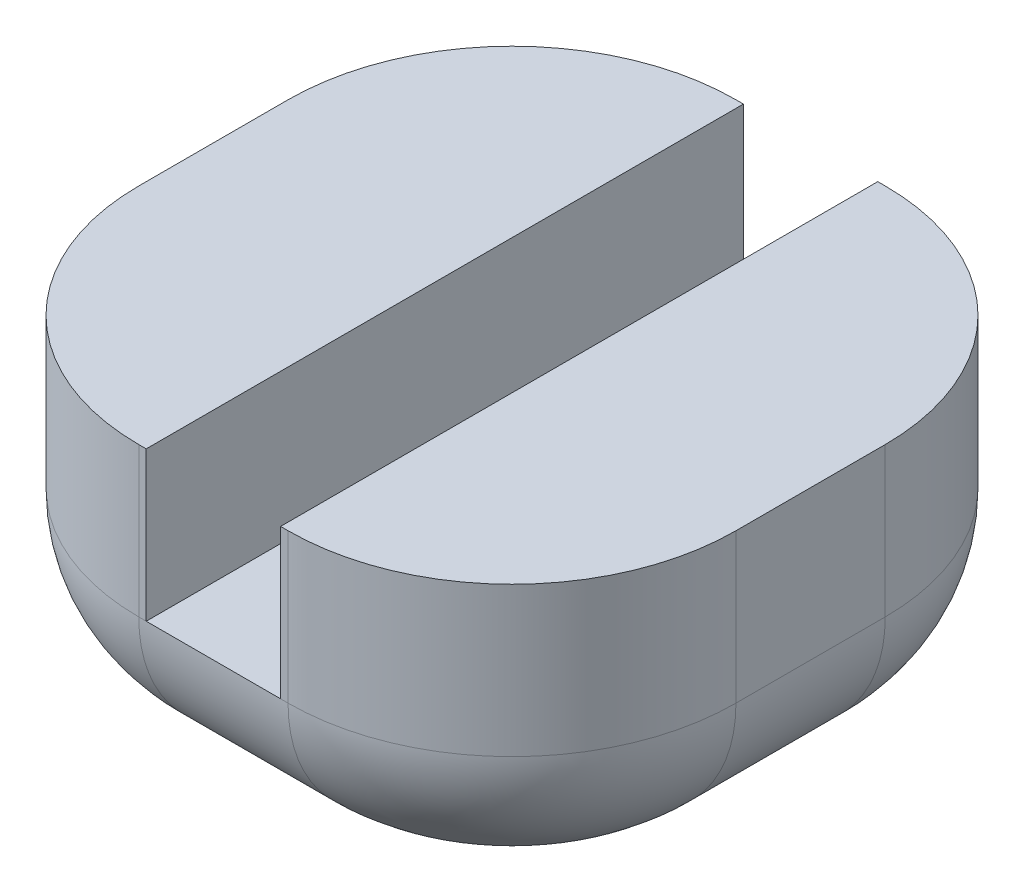
ISO-10303-21;
HEADER;
FILE_DESCRIPTION(('STEP AP214'),'2;1');
FILE_NAME('part.step','',(''),(''),'','','');
FILE_SCHEMA(('AUTOMOTIVE_DESIGN { 1 0 10303 214 1 1 1 1 }'));
ENDSEC;
DATA;
#1=APPLICATION_CONTEXT('core data for automotive mechanical design processes');
#2=APPLICATION_PROTOCOL_DEFINITION('international standard','automotive_design',2000,#1);
#3=PRODUCT_CONTEXT('',#1,'mechanical');
#4=PRODUCT('Part','Part','',(#3));
#5=PRODUCT_RELATED_PRODUCT_CATEGORY('part','',(#4));
#6=PRODUCT_DEFINITION_FORMATION('','',#4);
#7=PRODUCT_DEFINITION_CONTEXT('part definition',#1,'design');
#8=PRODUCT_DEFINITION('design','',#6,#7);
#9=PRODUCT_DEFINITION_SHAPE('','',#8);
#10=(LENGTH_UNIT() NAMED_UNIT(*) SI_UNIT(.MILLI.,.METRE.));
#11=(NAMED_UNIT(*) PLANE_ANGLE_UNIT() SI_UNIT($,.RADIAN.));
#12=(NAMED_UNIT(*) SI_UNIT($,.STERADIAN.) SOLID_ANGLE_UNIT());
#13=UNCERTAINTY_MEASURE_WITH_UNIT(LENGTH_MEASURE(1.E-05),#10,'distance_accuracy_value','');
#14=(GEOMETRIC_REPRESENTATION_CONTEXT(3) GLOBAL_UNCERTAINTY_ASSIGNED_CONTEXT((#13)) GLOBAL_UNIT_ASSIGNED_CONTEXT((#10,
#11,#12)) REPRESENTATION_CONTEXT('',''));
#15=CARTESIAN_POINT('',(0.,0.,0.));
#16=DIRECTION('',(0.,0.,1.));
#17=DIRECTION('',(1.,0.,0.));
#18=AXIS2_PLACEMENT_3D('',#15,#16,#17);
#19=CARTESIAN_POINT('',(2.,2.,-2.));
#20=DIRECTION('',(0.,0.,1.));
#21=DIRECTION('',(1.,0.,0.));
#22=AXIS2_PLACEMENT_3D('',#19,#20,#21);
#23=PLANE('',#22);
#24=DIRECTION('',(0.,-1.,0.));
#25=VECTOR('',#24,1.);
#26=CARTESIAN_POINT('',(0.5,2.,-2.));
#27=LINE('',#26,#25);
#28=CARTESIAN_POINT('',(0.5,2.,-2.));
#29=VERTEX_POINT('',#28);
#30=CARTESIAN_POINT('',(0.5,1.,-2.));
#31=VERTEX_POINT('',#30);
#32=EDGE_CURVE('E236',#29,#31,#27,.T.);
#33=ORIENTED_EDGE('',*,*,#32,.T.);
#34=DIRECTION('',(-1.,0.,0.));
#35=VECTOR('',#34,1.);
#36=CARTESIAN_POINT('',(2.,1.,-2.));
#37=LINE('',#36,#35);
#38=CARTESIAN_POINT('',(0.45,1.,-2.));
#39=VERTEX_POINT('',#38);
#40=EDGE_CURVE('E11',#31,#39,#37,.T.);
#41=ORIENTED_EDGE('',*,*,#40,.T.);
#42=DIRECTION('',(0.,1.,0.));
#43=VECTOR('',#42,1.);
#44=CARTESIAN_POINT('',(0.45,1.,-2.));
#45=LINE('',#44,#43);
#46=CARTESIAN_POINT('',(0.45,2.,-2.));
#47=VERTEX_POINT('',#46);
#48=EDGE_CURVE('E212',#39,#47,#45,.T.);
#49=ORIENTED_EDGE('',*,*,#48,.T.);
#50=DIRECTION('',(-1.,0.,0.));
#51=VECTOR('',#50,1.);
#52=CARTESIAN_POINT('',(2.,2.,-2.));
#53=LINE('',#52,#51);
#54=EDGE_CURVE('E229',#29,#47,#53,.T.);
#55=ORIENTED_EDGE('',*,*,#54,.F.);
#56=EDGE_LOOP('',(#33,#41,#49,#55));
#57=FACE_BOUND('',#56,.T.);
#58=ADVANCED_FACE('F38',(#57),#23,.F.);
#59=CARTESIAN_POINT('',(2.,2.,2.));
#60=DIRECTION('',(0.,0.,-1.));
#61=DIRECTION('',(-1.,0.,0.));
#62=AXIS2_PLACEMENT_3D('',#59,#60,#61);
#63=PLANE('',#62);
#64=DIRECTION('',(0.,-1.,0.));
#65=VECTOR('',#64,1.);
#66=CARTESIAN_POINT('',(-0.5,2.,2.));
#67=LINE('',#66,#65);
#68=CARTESIAN_POINT('',(-0.5,2.,2.));
#69=VERTEX_POINT('',#68);
#70=CARTESIAN_POINT('',(-0.5,1.,2.));
#71=VERTEX_POINT('',#70);
#72=EDGE_CURVE('E168',#69,#71,#67,.T.);
#73=ORIENTED_EDGE('',*,*,#72,.T.);
#74=DIRECTION('',(1.,0.,0.));
#75=VECTOR('',#74,1.);
#76=CARTESIAN_POINT('',(2.,1.,2.));
#77=LINE('',#76,#75);
#78=CARTESIAN_POINT('',(-0.45,1.,2.));
#79=VERTEX_POINT('',#78);
#80=EDGE_CURVE('E160',#71,#79,#77,.T.);
#81=ORIENTED_EDGE('',*,*,#80,.T.);
#82=DIRECTION('',(0.,1.,0.));
#83=VECTOR('',#82,1.);
#84=CARTESIAN_POINT('',(-0.45,1.,2.));
#85=LINE('',#84,#83);
#86=CARTESIAN_POINT('',(-0.45,2.,2.));
#87=VERTEX_POINT('',#86);
#88=EDGE_CURVE('E165',#79,#87,#85,.T.);
#89=ORIENTED_EDGE('',*,*,#88,.T.);
#90=DIRECTION('',(1.,0.,0.));
#91=VECTOR('',#90,1.);
#92=CARTESIAN_POINT('',(2.,2.,2.));
#93=LINE('',#92,#91);
#94=EDGE_CURVE('E223',#69,#87,#93,.T.);
#95=ORIENTED_EDGE('',*,*,#94,.F.);
#96=EDGE_LOOP('',(#73,#81,#89,#95));
#97=FACE_BOUND('',#96,.T.);
#98=ADVANCED_FACE('F162',(#97),#63,.F.);
#99=CARTESIAN_POINT('',(0.,2.,0.));
#100=DIRECTION('',(0.,1.,0.));
#101=DIRECTION('',(0.,0.,1.));
#102=AXIS2_PLACEMENT_3D('',#99,#100,#101);
#103=PLANE('',#102);
#104=DIRECTION('',(0.,0.,1.));
#105=VECTOR('',#104,1.);
#106=CARTESIAN_POINT('',(-0.45,2.,2.));
#107=LINE('',#106,#105);
#108=CARTESIAN_POINT('',(-0.45,2.,-2.));
#109=VERTEX_POINT('',#108);
#110=EDGE_CURVE('E192',#109,#87,#107,.T.);
#111=ORIENTED_EDGE('',*,*,#110,.F.);
#112=CARTESIAN_POINT('',(-0.5,2.,-2.));
#113=VERTEX_POINT('',#112);
#114=EDGE_CURVE('E228',#109,#113,#53,.T.);
#115=ORIENTED_EDGE('',*,*,#114,.T.);
#116=CARTESIAN_POINT('',(-0.5,2.,-0.499999999999999));
#117=DIRECTION('',(0.,1.,0.));
#118=DIRECTION('',(0.,0.,1.));
#119=AXIS2_PLACEMENT_3D('',#116,#117,#118);
#120=CIRCLE('',#119,1.5);
#121=CARTESIAN_POINT('',(-2.,2.,-0.499999999999999));
#122=VERTEX_POINT('',#121);
#123=EDGE_CURVE('E247',#113,#122,#120,.T.);
#124=ORIENTED_EDGE('',*,*,#123,.T.);
#125=DIRECTION('',(0.,0.,1.));
#126=VECTOR('',#125,1.);
#127=CARTESIAN_POINT('',(-2.,2.,2.));
#128=LINE('',#127,#126);
#129=CARTESIAN_POINT('',(-2.,2.,0.500000000000001));
#130=VERTEX_POINT('',#129);
#131=EDGE_CURVE('E219',#122,#130,#128,.T.);
#132=ORIENTED_EDGE('',*,*,#131,.T.);
#133=CARTESIAN_POINT('',(-0.5,2.,0.500000000000001));
#134=DIRECTION('',(0.,1.,0.));
#135=DIRECTION('',(0.,0.,1.));
#136=AXIS2_PLACEMENT_3D('',#133,#134,#135);
#137=CIRCLE('',#136,1.5);
#138=EDGE_CURVE('E241',#130,#69,#137,.T.);
#139=ORIENTED_EDGE('',*,*,#138,.T.);
#140=ORIENTED_EDGE('',*,*,#94,.T.);
#141=EDGE_LOOP('',(#111,#115,#124,#132,#139,#140));
#142=FACE_BOUND('',#141,.T.);
#143=ADVANCED_FACE('F324',(#142),#103,.T.);
#144=CARTESIAN_POINT('',(0.,0.,0.));
#145=DIRECTION('',(0.,1.,0.));
#146=DIRECTION('',(0.,0.,1.));
#147=AXIS2_PLACEMENT_3D('',#144,#145,#146);
#148=CYLINDRICAL_SURFACE('',#147,0.45);
#149=CARTESIAN_POINT('',(0.,0.,0.));
#150=DIRECTION('',(0.,1.,0.));
#151=DIRECTION('',(0.,0.,1.));
#152=AXIS2_PLACEMENT_3D('',#149,#150,#151);
#153=CIRCLE('',#152,0.45);
#154=CARTESIAN_POINT('',(0.,0.,0.45));
#155=VERTEX_POINT('',#154);
#156=EDGE_CURVE('E211',#155,#155,#153,.T.);
#157=ORIENTED_EDGE('',*,*,#156,.F.);
#158=EDGE_LOOP('',(#157));
#159=FACE_BOUND('',#158,.T.);
#160=CARTESIAN_POINT('',(0.,1.,0.));
#161=DIRECTION('',(0.,1.,0.));
#162=DIRECTION('',(0.,0.,1.));
#163=AXIS2_PLACEMENT_3D('',#160,#161,#162);
#164=CIRCLE('',#163,0.45);
#165=CARTESIAN_POINT('',(-0.45,1.,0.));
#166=VERTEX_POINT('',#165);
#167=CARTESIAN_POINT('',(0.45,1.,0.));
#168=VERTEX_POINT('',#167);
#169=EDGE_CURVE('E258',#166,#168,#164,.F.);
#170=ORIENTED_EDGE('',*,*,#169,.F.);
#171=EDGE_CURVE('E184',#168,#166,#164,.F.);
#172=ORIENTED_EDGE('',*,*,#171,.F.);
#173=EDGE_LOOP('',(#170,#172));
#174=FACE_BOUND('',#173,.T.);
#175=ADVANCED_FACE('F383',(#159,#174),#148,.F.);
#176=CARTESIAN_POINT('',(-2.,2.,2.));
#177=DIRECTION('',(1.,0.,0.));
#178=DIRECTION('',(0.,0.,-1.));
#179=AXIS2_PLACEMENT_3D('',#176,#177,#178);
#180=PLANE('',#179);
#181=DIRECTION('',(0.,-1.,0.));
#182=VECTOR('',#181,1.);
#183=CARTESIAN_POINT('',(-2.,2.,-0.499999999999999));
#184=LINE('',#183,#182);
#185=CARTESIAN_POINT('',(-2.,1.,-0.499999999999999));
#186=VERTEX_POINT('',#185);
#187=EDGE_CURVE('E234',#122,#186,#184,.T.);
#188=ORIENTED_EDGE('',*,*,#187,.T.);
#189=DIRECTION('',(0.,0.,1.));
#190=VECTOR('',#189,1.);
#191=CARTESIAN_POINT('',(-2.,1.,2.));
#192=LINE('',#191,#190);
#193=CARTESIAN_POINT('',(-2.,1.,0.500000000000001));
#194=VERTEX_POINT('',#193);
#195=EDGE_CURVE('E285',#186,#194,#192,.T.);
#196=ORIENTED_EDGE('',*,*,#195,.T.);
#197=DIRECTION('',(0.,-1.,0.));
#198=VECTOR('',#197,1.);
#199=CARTESIAN_POINT('',(-2.,2.,0.500000000000001));
#200=LINE('',#199,#198);
#201=EDGE_CURVE('E232',#194,#130,#200,.F.);
#202=ORIENTED_EDGE('',*,*,#201,.T.);
#203=ORIENTED_EDGE('',*,*,#131,.F.);
#204=EDGE_LOOP('',(#188,#196,#202,#203));
#205=FACE_BOUND('',#204,.T.);
#206=ADVANCED_FACE('F322',(#205),#180,.F.);
#207=DIRECTION('',(0.,1.,0.));
#208=VECTOR('',#207,1.);
#209=CARTESIAN_POINT('',(0.45,1.,2.));
#210=LINE('',#209,#208);
#211=CARTESIAN_POINT('',(0.45,1.,2.));
#212=VERTEX_POINT('',#211);
#213=CARTESIAN_POINT('',(0.45,2.,2.));
#214=VERTEX_POINT('',#213);
#215=EDGE_CURVE('E193',#212,#214,#210,.T.);
#216=ORIENTED_EDGE('',*,*,#215,.F.);
#217=DIRECTION('',(1.,0.,0.));
#218=VECTOR('',#217,1.);
#219=CARTESIAN_POINT('',(2.,1.,2.));
#220=LINE('',#219,#218);
#221=CARTESIAN_POINT('',(0.5,1.,2.));
#222=VERTEX_POINT('',#221);
#223=EDGE_CURVE('E174',#212,#222,#220,.T.);
#224=ORIENTED_EDGE('',*,*,#223,.T.);
#225=DIRECTION('',(0.,-1.,0.));
#226=VECTOR('',#225,1.);
#227=CARTESIAN_POINT('',(0.5,2.,2.));
#228=LINE('',#227,#226);
#229=CARTESIAN_POINT('',(0.5,2.,2.));
#230=VERTEX_POINT('',#229);
#231=EDGE_CURVE('E255',#222,#230,#228,.F.);
#232=ORIENTED_EDGE('',*,*,#231,.T.);
#233=EDGE_CURVE('E222',#214,#230,#93,.T.);
#234=ORIENTED_EDGE('',*,*,#233,.F.);
#235=EDGE_LOOP('',(#216,#224,#232,#234));
#236=FACE_BOUND('',#235,.T.);
#237=ADVANCED_FACE('F374',(#236),#63,.F.);
#238=CARTESIAN_POINT('',(2.,2.,2.));
#239=DIRECTION('',(-1.,0.,0.));
#240=DIRECTION('',(0.,0.,1.));
#241=AXIS2_PLACEMENT_3D('',#238,#239,#240);
#242=PLANE('',#241);
#243=DIRECTION('',(0.,-1.,0.));
#244=VECTOR('',#243,1.);
#245=CARTESIAN_POINT('',(2.,2.,0.500000000000001));
#246=LINE('',#245,#244);
#247=CARTESIAN_POINT('',(2.,2.,0.500000000000001));
#248=VERTEX_POINT('',#247);
#249=CARTESIAN_POINT('',(2.,1.,0.500000000000001));
#250=VERTEX_POINT('',#249);
#251=EDGE_CURVE('E249',#248,#250,#246,.T.);
#252=ORIENTED_EDGE('',*,*,#251,.T.);
#253=DIRECTION('',(0.,0.,-1.));
#254=VECTOR('',#253,1.);
#255=CARTESIAN_POINT('',(2.,1.,2.));
#256=LINE('',#255,#254);
#257=CARTESIAN_POINT('',(2.,1.,-0.499999999999999));
#258=VERTEX_POINT('',#257);
#259=EDGE_CURVE('E279',#250,#258,#256,.T.);
#260=ORIENTED_EDGE('',*,*,#259,.T.);
#261=DIRECTION('',(0.,-1.,0.));
#262=VECTOR('',#261,1.);
#263=CARTESIAN_POINT('',(2.,2.,-0.499999999999999));
#264=LINE('',#263,#262);
#265=CARTESIAN_POINT('',(2.,2.,-0.499999999999999));
#266=VERTEX_POINT('',#265);
#267=EDGE_CURVE('E252',#258,#266,#264,.F.);
#268=ORIENTED_EDGE('',*,*,#267,.T.);
#269=DIRECTION('',(0.,0.,-1.));
#270=VECTOR('',#269,1.);
#271=CARTESIAN_POINT('',(2.,2.,2.));
#272=LINE('',#271,#270);
#273=EDGE_CURVE('E225',#248,#266,#272,.T.);
#274=ORIENTED_EDGE('',*,*,#273,.F.);
#275=EDGE_LOOP('',(#252,#260,#268,#274));
#276=FACE_BOUND('',#275,.T.);
#277=ADVANCED_FACE('F356',(#276),#242,.F.);
#278=DIRECTION('',(0.,1.,0.));
#279=VECTOR('',#278,1.);
#280=CARTESIAN_POINT('',(-0.45,1.,-2.));
#281=LINE('',#280,#279);
#282=CARTESIAN_POINT('',(-0.45,1.,-2.));
#283=VERTEX_POINT('',#282);
#284=EDGE_CURVE('E209',#283,#109,#281,.T.);
#285=ORIENTED_EDGE('',*,*,#284,.F.);
#286=DIRECTION('',(-1.,0.,0.));
#287=VECTOR('',#286,1.);
#288=CARTESIAN_POINT('',(2.,1.,-2.));
#289=LINE('',#288,#287);
#290=CARTESIAN_POINT('',(-0.5,1.,-2.));
#291=VERTEX_POINT('',#290);
#292=EDGE_CURVE('E47',#283,#291,#289,.T.);
#293=ORIENTED_EDGE('',*,*,#292,.T.);
#294=DIRECTION('',(0.,-1.,0.));
#295=VECTOR('',#294,1.);
#296=CARTESIAN_POINT('',(-0.5,2.,-2.));
#297=LINE('',#296,#295);
#298=EDGE_CURVE('E239',#291,#113,#297,.F.);
#299=ORIENTED_EDGE('',*,*,#298,.T.);
#300=ORIENTED_EDGE('',*,*,#114,.F.);
#301=EDGE_LOOP('',(#285,#293,#299,#300));
#302=FACE_BOUND('',#301,.T.);
#303=ADVANCED_FACE('F381',(#302),#23,.F.);
#304=DIRECTION('',(0.,0.,-1.));
#305=VECTOR('',#304,1.);
#306=CARTESIAN_POINT('',(0.45,2.,2.));
#307=LINE('',#306,#305);
#308=EDGE_CURVE('E188',#214,#47,#307,.T.);
#309=ORIENTED_EDGE('',*,*,#308,.F.);
#310=ORIENTED_EDGE('',*,*,#233,.T.);
#311=CARTESIAN_POINT('',(0.5,2.,0.500000000000001));
#312=DIRECTION('',(0.,1.,0.));
#313=DIRECTION('',(0.,0.,1.));
#314=AXIS2_PLACEMENT_3D('',#311,#312,#313);
#315=CIRCLE('',#314,1.5);
#316=EDGE_CURVE('E243',#230,#248,#315,.T.);
#317=ORIENTED_EDGE('',*,*,#316,.T.);
#318=ORIENTED_EDGE('',*,*,#273,.T.);
#319=CARTESIAN_POINT('',(0.5,2.,-0.499999999999999));
#320=DIRECTION('',(0.,1.,0.));
#321=DIRECTION('',(0.,0.,1.));
#322=AXIS2_PLACEMENT_3D('',#319,#320,#321);
#323=CIRCLE('',#322,1.5);
#324=EDGE_CURVE('E245',#266,#29,#323,.T.);
#325=ORIENTED_EDGE('',*,*,#324,.T.);
#326=ORIENTED_EDGE('',*,*,#54,.T.);
#327=EDGE_LOOP('',(#309,#310,#317,#318,#325,#326));
#328=FACE_BOUND('',#327,.T.);
#329=ADVANCED_FACE('F360',(#328),#103,.T.);
#330=CARTESIAN_POINT('',(0.,0.,0.));
#331=DIRECTION('',(0.,1.,0.));
#332=DIRECTION('',(0.,0.,1.));
#333=AXIS2_PLACEMENT_3D('',#330,#331,#332);
#334=PLANE('',#333);
#335=DIRECTION('',(-1.,0.,0.));
#336=VECTOR('',#335,1.);
#337=CARTESIAN_POINT('',(0.,0.,-0.999999999999999));
#338=LINE('',#337,#336);
#339=CARTESIAN_POINT('',(-0.5,0.,-0.999999999999999));
#340=VERTEX_POINT('',#339);
#341=CARTESIAN_POINT('',(0.5,0.,-0.999999999999999));
#342=VERTEX_POINT('',#341);
#343=EDGE_CURVE('E259',#340,#342,#338,.F.);
#344=ORIENTED_EDGE('',*,*,#343,.T.);
#345=CARTESIAN_POINT('',(0.5,0.,-0.499999999999999));
#346=DIRECTION('',(0.,1.,0.));
#347=DIRECTION('',(0.,0.,1.));
#348=AXIS2_PLACEMENT_3D('',#345,#346,#347);
#349=CIRCLE('',#348,0.5);
#350=CARTESIAN_POINT('',(1.,0.,-0.499999999999999));
#351=VERTEX_POINT('',#350);
#352=EDGE_CURVE('E273',#342,#351,#349,.F.);
#353=ORIENTED_EDGE('',*,*,#352,.T.);
#354=DIRECTION('',(0.,0.,-1.));
#355=VECTOR('',#354,1.);
#356=CARTESIAN_POINT('',(1.,0.,0.));
#357=LINE('',#356,#355);
#358=CARTESIAN_POINT('',(1.,0.,0.500000000000001));
#359=VERTEX_POINT('',#358);
#360=EDGE_CURVE('E271',#351,#359,#357,.F.);
#361=ORIENTED_EDGE('',*,*,#360,.T.);
#362=CARTESIAN_POINT('',(0.5,0.,0.500000000000001));
#363=DIRECTION('',(0.,1.,0.));
#364=DIRECTION('',(0.,0.,1.));
#365=AXIS2_PLACEMENT_3D('',#362,#363,#364);
#366=CIRCLE('',#365,0.5);
#367=CARTESIAN_POINT('',(0.5,0.,1.));
#368=VERTEX_POINT('',#367);
#369=EDGE_CURVE('E269',#359,#368,#366,.F.);
#370=ORIENTED_EDGE('',*,*,#369,.T.);
#371=DIRECTION('',(1.,0.,0.));
#372=VECTOR('',#371,1.);
#373=CARTESIAN_POINT('',(0.,0.,1.));
#374=LINE('',#373,#372);
#375=CARTESIAN_POINT('',(-0.5,0.,1.));
#376=VERTEX_POINT('',#375);
#377=EDGE_CURVE('E267',#368,#376,#374,.F.);
#378=ORIENTED_EDGE('',*,*,#377,.T.);
#379=CARTESIAN_POINT('',(-0.5,0.,0.500000000000001));
#380=DIRECTION('',(0.,1.,0.));
#381=DIRECTION('',(0.,0.,1.));
#382=AXIS2_PLACEMENT_3D('',#379,#380,#381);
#383=CIRCLE('',#382,0.5);
#384=CARTESIAN_POINT('',(-1.,0.,0.500000000000001));
#385=VERTEX_POINT('',#384);
#386=EDGE_CURVE('E265',#376,#385,#383,.F.);
#387=ORIENTED_EDGE('',*,*,#386,.T.);
#388=DIRECTION('',(0.,0.,1.));
#389=VECTOR('',#388,1.);
#390=CARTESIAN_POINT('',(-1.,0.,0.));
#391=LINE('',#390,#389);
#392=CARTESIAN_POINT('',(-1.,0.,-0.499999999999999));
#393=VERTEX_POINT('',#392);
#394=EDGE_CURVE('E263',#385,#393,#391,.F.);
#395=ORIENTED_EDGE('',*,*,#394,.T.);
#396=CARTESIAN_POINT('',(-0.5,0.,-0.499999999999999));
#397=DIRECTION('',(0.,1.,0.));
#398=DIRECTION('',(0.,0.,1.));
#399=AXIS2_PLACEMENT_3D('',#396,#397,#398);
#400=CIRCLE('',#399,0.5);
#401=EDGE_CURVE('E261',#393,#340,#400,.F.);
#402=ORIENTED_EDGE('',*,*,#401,.T.);
#403=EDGE_LOOP('',(#344,#353,#361,#370,#378,#387,#395,#402));
#404=FACE_BOUND('',#403,.T.);
#405=ORIENTED_EDGE('',*,*,#156,.T.);
#406=EDGE_LOOP('',(#405));
#407=FACE_BOUND('',#406,.T.);
#408=ADVANCED_FACE('F341',(#404,#407),#334,.F.);
#409=CARTESIAN_POINT('',(-0.5,2.,-0.499999999999999));
#410=DIRECTION('',(0.,-1.,0.));
#411=DIRECTION('',(0.,0.,-1.));
#412=AXIS2_PLACEMENT_3D('',#409,#410,#411);
#413=CYLINDRICAL_SURFACE('',#412,1.5);
#414=ORIENTED_EDGE('',*,*,#298,.F.);
#415=CARTESIAN_POINT('',(-0.5,1.,-0.499999999999999));
#416=DIRECTION('',(0.,1.,0.));
#417=DIRECTION('',(0.,0.,1.));
#418=AXIS2_PLACEMENT_3D('',#415,#416,#417);
#419=CIRCLE('',#418,1.5);
#420=EDGE_CURVE('E61',#291,#186,#419,.T.);
#421=ORIENTED_EDGE('',*,*,#420,.T.);
#422=ORIENTED_EDGE('',*,*,#187,.F.);
#423=ORIENTED_EDGE('',*,*,#123,.F.);
#424=EDGE_LOOP('',(#414,#421,#422,#423));
#425=FACE_BOUND('',#424,.T.);
#426=ADVANCED_FACE('F328',(#425),#413,.T.);
#427=CARTESIAN_POINT('',(0.5,2.,-0.499999999999999));
#428=DIRECTION('',(0.,-1.,0.));
#429=DIRECTION('',(0.,0.,-1.));
#430=AXIS2_PLACEMENT_3D('',#427,#428,#429);
#431=CYLINDRICAL_SURFACE('',#430,1.5);
#432=ORIENTED_EDGE('',*,*,#267,.F.);
#433=CARTESIAN_POINT('',(0.5,1.,-0.499999999999999));
#434=DIRECTION('',(0.,1.,0.));
#435=DIRECTION('',(0.,0.,1.));
#436=AXIS2_PLACEMENT_3D('',#433,#434,#435);
#437=CIRCLE('',#436,1.5);
#438=EDGE_CURVE('E276',#258,#31,#437,.T.);
#439=ORIENTED_EDGE('',*,*,#438,.T.);
#440=ORIENTED_EDGE('',*,*,#32,.F.);
#441=ORIENTED_EDGE('',*,*,#324,.F.);
#442=EDGE_LOOP('',(#432,#439,#440,#441));
#443=FACE_BOUND('',#442,.T.);
#444=ADVANCED_FACE('F365',(#443),#431,.T.);
#445=CARTESIAN_POINT('',(0.5,2.,0.500000000000001));
#446=DIRECTION('',(0.,-1.,0.));
#447=DIRECTION('',(0.,0.,-1.));
#448=AXIS2_PLACEMENT_3D('',#445,#446,#447);
#449=CYLINDRICAL_SURFACE('',#448,1.5);
#450=ORIENTED_EDGE('',*,*,#231,.F.);
#451=CARTESIAN_POINT('',(0.5,1.,0.500000000000001));
#452=DIRECTION('',(0.,1.,0.));
#453=DIRECTION('',(0.,0.,1.));
#454=AXIS2_PLACEMENT_3D('',#451,#452,#453);
#455=CIRCLE('',#454,1.5);
#456=EDGE_CURVE('E281',#222,#250,#455,.T.);
#457=ORIENTED_EDGE('',*,*,#456,.T.);
#458=ORIENTED_EDGE('',*,*,#251,.F.);
#459=ORIENTED_EDGE('',*,*,#316,.F.);
#460=EDGE_LOOP('',(#450,#457,#458,#459));
#461=FACE_BOUND('',#460,.T.);
#462=ADVANCED_FACE('F352',(#461),#449,.T.);
#463=CARTESIAN_POINT('',(-0.5,2.,0.500000000000001));
#464=DIRECTION('',(0.,-1.,0.));
#465=DIRECTION('',(0.,0.,-1.));
#466=AXIS2_PLACEMENT_3D('',#463,#464,#465);
#467=CYLINDRICAL_SURFACE('',#466,1.5);
#468=ORIENTED_EDGE('',*,*,#201,.F.);
#469=CARTESIAN_POINT('',(-0.5,1.,0.500000000000001));
#470=DIRECTION('',(0.,1.,0.));
#471=DIRECTION('',(0.,0.,1.));
#472=AXIS2_PLACEMENT_3D('',#469,#470,#471);
#473=CIRCLE('',#472,1.5);
#474=EDGE_CURVE('E173',#194,#71,#473,.T.);
#475=ORIENTED_EDGE('',*,*,#474,.T.);
#476=ORIENTED_EDGE('',*,*,#72,.F.);
#477=ORIENTED_EDGE('',*,*,#138,.F.);
#478=EDGE_LOOP('',(#468,#475,#476,#477));
#479=FACE_BOUND('',#478,.T.);
#480=ADVANCED_FACE('F318',(#479),#467,.T.);
#481=CARTESIAN_POINT('',(-0.45,1.,2.));
#482=DIRECTION('',(-1.,0.,0.));
#483=DIRECTION('',(0.,0.,1.));
#484=AXIS2_PLACEMENT_3D('',#481,#482,#483);
#485=PLANE('',#484);
#486=ORIENTED_EDGE('',*,*,#110,.T.);
#487=ORIENTED_EDGE('',*,*,#88,.F.);
#488=DIRECTION('',(0.,0.,1.));
#489=VECTOR('',#488,1.);
#490=CARTESIAN_POINT('',(-0.45,1.,2.));
#491=LINE('',#490,#489);
#492=EDGE_CURVE('E179',#166,#79,#491,.T.);
#493=ORIENTED_EDGE('',*,*,#492,.F.);
#494=EDGE_CURVE('E187',#283,#166,#491,.T.);
#495=ORIENTED_EDGE('',*,*,#494,.F.);
#496=ORIENTED_EDGE('',*,*,#284,.T.);
#497=EDGE_LOOP('',(#486,#487,#493,#495,#496));
#498=FACE_BOUND('',#497,.T.);
#499=ADVANCED_FACE('F190',(#498),#485,.F.);
#500=CARTESIAN_POINT('',(0.45,1.,2.));
#501=DIRECTION('',(1.,0.,0.));
#502=DIRECTION('',(0.,0.,-1.));
#503=AXIS2_PLACEMENT_3D('',#500,#501,#502);
#504=PLANE('',#503);
#505=ORIENTED_EDGE('',*,*,#308,.T.);
#506=ORIENTED_EDGE('',*,*,#48,.F.);
#507=DIRECTION('',(0.,0.,-1.));
#508=VECTOR('',#507,1.);
#509=CARTESIAN_POINT('',(0.45,1.,2.));
#510=LINE('',#509,#508);
#511=EDGE_CURVE('E199',#168,#39,#510,.T.);
#512=ORIENTED_EDGE('',*,*,#511,.F.);
#513=EDGE_CURVE('E202',#212,#168,#510,.T.);
#514=ORIENTED_EDGE('',*,*,#513,.F.);
#515=ORIENTED_EDGE('',*,*,#215,.T.);
#516=EDGE_LOOP('',(#505,#506,#512,#514,#515));
#517=FACE_BOUND('',#516,.T.);
#518=ADVANCED_FACE('F371',(#517),#504,.F.);
#519=CARTESIAN_POINT('',(0.,1.,0.));
#520=DIRECTION('',(0.,1.,0.));
#521=DIRECTION('',(0.,0.,1.));
#522=AXIS2_PLACEMENT_3D('',#519,#520,#521);
#523=PLANE('',#522);
#524=ORIENTED_EDGE('',*,*,#169,.T.);
#525=ORIENTED_EDGE('',*,*,#511,.T.);
#526=DIRECTION('',(-1.,0.,0.));
#527=VECTOR('',#526,1.);
#528=CARTESIAN_POINT('',(0.45,1.,-2.));
#529=LINE('',#528,#527);
#530=EDGE_CURVE('E194',#39,#283,#529,.T.);
#531=ORIENTED_EDGE('',*,*,#530,.T.);
#532=ORIENTED_EDGE('',*,*,#494,.T.);
#533=EDGE_LOOP('',(#524,#525,#531,#532));
#534=FACE_BOUND('',#533,.T.);
#535=ADVANCED_FACE('F399',(#534),#523,.T.);
#536=ORIENTED_EDGE('',*,*,#171,.T.);
#537=ORIENTED_EDGE('',*,*,#492,.T.);
#538=DIRECTION('',(1.,0.,0.));
#539=VECTOR('',#538,1.);
#540=CARTESIAN_POINT('',(0.45,1.,2.));
#541=LINE('',#540,#539);
#542=EDGE_CURVE('E181',#79,#212,#541,.T.);
#543=ORIENTED_EDGE('',*,*,#542,.T.);
#544=ORIENTED_EDGE('',*,*,#513,.T.);
#545=EDGE_LOOP('',(#536,#537,#543,#544));
#546=FACE_BOUND('',#545,.T.);
#547=ADVANCED_FACE('F180',(#546),#523,.T.);
#548=CARTESIAN_POINT('',(-0.5,1.,0.500000000000001));
#549=DIRECTION('',(0.,1.,0.));
#550=DIRECTION('',(0.,0.,1.));
#551=AXIS2_PLACEMENT_3D('',#548,#549,#550);
#552=DEGENERATE_TOROIDAL_SURFACE('',#551,0.5,1.,.T.);
#553=CARTESIAN_POINT('',(-0.5,1.,1.));
#554=DIRECTION('',(1.,0.,0.));
#555=DIRECTION('',(0.,0.,-1.));
#556=AXIS2_PLACEMENT_3D('',#553,#554,#555);
#557=CIRCLE('',#556,1.);
#558=EDGE_CURVE('E304',#71,#376,#557,.T.);
#559=ORIENTED_EDGE('',*,*,#558,.F.);
#560=ORIENTED_EDGE('',*,*,#474,.F.);
#561=CARTESIAN_POINT('',(-1.,1.,0.500000000000001));
#562=DIRECTION('',(0.,0.,-1.));
#563=DIRECTION('',(-1.,0.,0.));
#564=AXIS2_PLACEMENT_3D('',#561,#562,#563);
#565=CIRCLE('',#564,1.);
#566=EDGE_CURVE('E42',#385,#194,#565,.T.);
#567=ORIENTED_EDGE('',*,*,#566,.F.);
#568=ORIENTED_EDGE('',*,*,#386,.F.);
#569=EDGE_LOOP('',(#559,#560,#567,#568));
#570=FACE_BOUND('',#569,.T.);
#571=ADVANCED_FACE('F40',(#570),#552,.T.);
#572=CARTESIAN_POINT('',(-1.,1.,2.));
#573=DIRECTION('',(0.,0.,1.));
#574=DIRECTION('',(1.,0.,0.));
#575=AXIS2_PLACEMENT_3D('',#572,#573,#574);
#576=CYLINDRICAL_SURFACE('',#575,1.);
#577=ORIENTED_EDGE('',*,*,#566,.T.);
#578=ORIENTED_EDGE('',*,*,#195,.F.);
#579=CARTESIAN_POINT('',(-1.,1.,-0.499999999999999));
#580=DIRECTION('',(0.,0.,-1.));
#581=DIRECTION('',(-1.,0.,0.));
#582=AXIS2_PLACEMENT_3D('',#579,#580,#581);
#583=CIRCLE('',#582,1.);
#584=EDGE_CURVE('E302',#393,#186,#583,.T.);
#585=ORIENTED_EDGE('',*,*,#584,.F.);
#586=ORIENTED_EDGE('',*,*,#394,.F.);
#587=EDGE_LOOP('',(#577,#578,#585,#586));
#588=FACE_BOUND('',#587,.T.);
#589=ADVANCED_FACE('F311',(#588),#576,.T.);
#590=CARTESIAN_POINT('',(2.,1.,1.));
#591=DIRECTION('',(1.,0.,0.));
#592=DIRECTION('',(0.,0.,-1.));
#593=AXIS2_PLACEMENT_3D('',#590,#591,#592);
#594=CYLINDRICAL_SURFACE('',#593,1.);
#595=ORIENTED_EDGE('',*,*,#558,.T.);
#596=ORIENTED_EDGE('',*,*,#377,.F.);
#597=CARTESIAN_POINT('',(0.5,1.,1.));
#598=DIRECTION('',(1.,0.,0.));
#599=DIRECTION('',(0.,0.,-1.));
#600=AXIS2_PLACEMENT_3D('',#597,#598,#599);
#601=CIRCLE('',#600,1.);
#602=EDGE_CURVE('E299',#222,#368,#601,.T.);
#603=ORIENTED_EDGE('',*,*,#602,.F.);
#604=ORIENTED_EDGE('',*,*,#223,.F.);
#605=ORIENTED_EDGE('',*,*,#542,.F.);
#606=ORIENTED_EDGE('',*,*,#80,.F.);
#607=EDGE_LOOP('',(#595,#596,#603,#604,#605,#606));
#608=FACE_BOUND('',#607,.T.);
#609=ADVANCED_FACE('F197',(#608),#594,.T.);
#610=CARTESIAN_POINT('',(-0.5,1.,-0.499999999999999));
#611=DIRECTION('',(0.,1.,0.));
#612=DIRECTION('',(0.,0.,1.));
#613=AXIS2_PLACEMENT_3D('',#610,#611,#612);
#614=DEGENERATE_TOROIDAL_SURFACE('',#613,0.5,1.,.T.);
#615=ORIENTED_EDGE('',*,*,#584,.T.);
#616=ORIENTED_EDGE('',*,*,#420,.F.);
#617=CARTESIAN_POINT('',(-0.5,1.,-0.999999999999999));
#618=DIRECTION('',(1.,0.,0.));
#619=DIRECTION('',(0.,0.,-1.));
#620=AXIS2_PLACEMENT_3D('',#617,#618,#619);
#621=CIRCLE('',#620,1.);
#622=EDGE_CURVE('E296',#340,#291,#621,.T.);
#623=ORIENTED_EDGE('',*,*,#622,.F.);
#624=ORIENTED_EDGE('',*,*,#401,.F.);
#625=EDGE_LOOP('',(#615,#616,#623,#624));
#626=FACE_BOUND('',#625,.T.);
#627=ADVANCED_FACE('F331',(#626),#614,.T.);
#628=CARTESIAN_POINT('',(0.5,1.,0.500000000000001));
#629=DIRECTION('',(0.,1.,0.));
#630=DIRECTION('',(0.,0.,1.));
#631=AXIS2_PLACEMENT_3D('',#628,#629,#630);
#632=DEGENERATE_TOROIDAL_SURFACE('',#631,0.5,1.,.T.);
#633=ORIENTED_EDGE('',*,*,#602,.T.);
#634=ORIENTED_EDGE('',*,*,#369,.F.);
#635=CARTESIAN_POINT('',(1.,1.,0.500000000000001));
#636=DIRECTION('',(0.,0.,-1.));
#637=DIRECTION('',(-1.,0.,0.));
#638=AXIS2_PLACEMENT_3D('',#635,#636,#637);
#639=CIRCLE('',#638,1.);
#640=EDGE_CURVE('E293',#250,#359,#639,.T.);
#641=ORIENTED_EDGE('',*,*,#640,.F.);
#642=ORIENTED_EDGE('',*,*,#456,.F.);
#643=EDGE_LOOP('',(#633,#634,#641,#642));
#644=FACE_BOUND('',#643,.T.);
#645=ADVANCED_FACE('F346',(#644),#632,.T.);
#646=CARTESIAN_POINT('',(2.,1.,-0.999999999999999));
#647=DIRECTION('',(-1.,0.,0.));
#648=DIRECTION('',(0.,0.,1.));
#649=AXIS2_PLACEMENT_3D('',#646,#647,#648);
#650=CYLINDRICAL_SURFACE('',#649,1.);
#651=ORIENTED_EDGE('',*,*,#530,.F.);
#652=ORIENTED_EDGE('',*,*,#40,.F.);
#653=CARTESIAN_POINT('',(0.5,1.,-0.999999999999999));
#654=DIRECTION('',(1.,0.,0.));
#655=DIRECTION('',(0.,0.,-1.));
#656=AXIS2_PLACEMENT_3D('',#653,#654,#655);
#657=CIRCLE('',#656,1.);
#658=EDGE_CURVE('E291',#342,#31,#657,.T.);
#659=ORIENTED_EDGE('',*,*,#658,.F.);
#660=ORIENTED_EDGE('',*,*,#343,.F.);
#661=ORIENTED_EDGE('',*,*,#622,.T.);
#662=ORIENTED_EDGE('',*,*,#292,.F.);
#663=EDGE_LOOP('',(#651,#652,#659,#660,#661,#662));
#664=FACE_BOUND('',#663,.T.);
#665=ADVANCED_FACE('F336',(#664),#650,.T.);
#666=CARTESIAN_POINT('',(1.,1.,2.));
#667=DIRECTION('',(0.,0.,-1.));
#668=DIRECTION('',(-1.,0.,0.));
#669=AXIS2_PLACEMENT_3D('',#666,#667,#668);
#670=CYLINDRICAL_SURFACE('',#669,1.);
#671=ORIENTED_EDGE('',*,*,#640,.T.);
#672=ORIENTED_EDGE('',*,*,#360,.F.);
#673=CARTESIAN_POINT('',(1.,1.,-0.499999999999999));
#674=DIRECTION('',(0.,0.,-1.));
#675=DIRECTION('',(-1.,0.,0.));
#676=AXIS2_PLACEMENT_3D('',#673,#674,#675);
#677=CIRCLE('',#676,1.);
#678=EDGE_CURVE('E289',#258,#351,#677,.T.);
#679=ORIENTED_EDGE('',*,*,#678,.F.);
#680=ORIENTED_EDGE('',*,*,#259,.F.);
#681=EDGE_LOOP('',(#671,#672,#679,#680));
#682=FACE_BOUND('',#681,.T.);
#683=ADVANCED_FACE('F427',(#682),#670,.T.);
#684=CARTESIAN_POINT('',(0.5,1.,-0.499999999999999));
#685=DIRECTION('',(0.,1.,0.));
#686=DIRECTION('',(0.,0.,1.));
#687=AXIS2_PLACEMENT_3D('',#684,#685,#686);
#688=DEGENERATE_TOROIDAL_SURFACE('',#687,0.5,1.,.T.);
#689=ORIENTED_EDGE('',*,*,#658,.T.);
#690=ORIENTED_EDGE('',*,*,#438,.F.);
#691=ORIENTED_EDGE('',*,*,#678,.T.);
#692=ORIENTED_EDGE('',*,*,#352,.F.);
#693=EDGE_LOOP('',(#689,#690,#691,#692));
#694=FACE_BOUND('',#693,.T.);
#695=ADVANCED_FACE('F424',(#694),#688,.T.);
#696=CLOSED_SHELL('',(#58,#98,#143,#175,#206,#237,#277,#303,#329,#408,#426,#444,#462,#480,#499,
#518,#535,#547,#571,#589,#609,#627,#645,#665,#683,#695));
#697=MANIFOLD_SOLID_BREP('B2',#696);
#698=ADVANCED_BREP_SHAPE_REPRESENTATION('',(#18,#697),#14);
#699=SHAPE_DEFINITION_REPRESENTATION(#9,#698);
ENDSEC;
END-ISO-10303-21;
